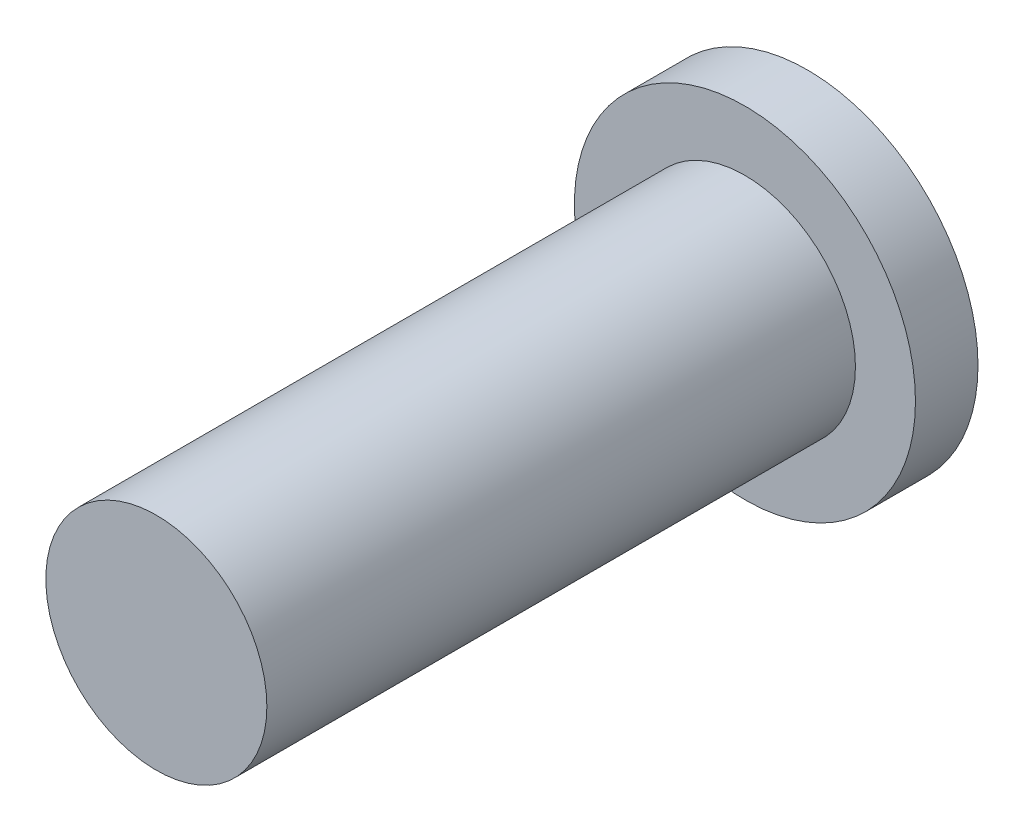
ISO-10303-21;
HEADER;
FILE_DESCRIPTION(('STEP AP214'),'2;1');
FILE_NAME('part.step','',(''),(''),'','','');
FILE_SCHEMA(('AUTOMOTIVE_DESIGN { 1 0 10303 214 1 1 1 1 }'));
ENDSEC;
DATA;
#1=APPLICATION_CONTEXT('core data for automotive mechanical design processes');
#2=APPLICATION_PROTOCOL_DEFINITION('international standard','automotive_design',2000,#1);
#3=PRODUCT_CONTEXT('',#1,'mechanical');
#4=PRODUCT('Part','Part','',(#3));
#5=PRODUCT_RELATED_PRODUCT_CATEGORY('part','',(#4));
#6=PRODUCT_DEFINITION_FORMATION('','',#4);
#7=PRODUCT_DEFINITION_CONTEXT('part definition',#1,'design');
#8=PRODUCT_DEFINITION('design','',#6,#7);
#9=PRODUCT_DEFINITION_SHAPE('','',#8);
#10=(LENGTH_UNIT() NAMED_UNIT(*) SI_UNIT(.MILLI.,.METRE.));
#11=(NAMED_UNIT(*) PLANE_ANGLE_UNIT() SI_UNIT($,.RADIAN.));
#12=(NAMED_UNIT(*) SI_UNIT($,.STERADIAN.) SOLID_ANGLE_UNIT());
#13=UNCERTAINTY_MEASURE_WITH_UNIT(LENGTH_MEASURE(1.E-05),#10,'distance_accuracy_value','');
#14=(GEOMETRIC_REPRESENTATION_CONTEXT(3) GLOBAL_UNCERTAINTY_ASSIGNED_CONTEXT((#13)) GLOBAL_UNIT_ASSIGNED_CONTEXT((#10,
#11,#12)) REPRESENTATION_CONTEXT('',''));
#15=CARTESIAN_POINT('',(0.,0.,0.));
#16=DIRECTION('',(0.,0.,1.));
#17=DIRECTION('',(1.,0.,0.));
#18=AXIS2_PLACEMENT_3D('',#15,#16,#17);
#19=CARTESIAN_POINT('',(0.,0.,85.));
#20=DIRECTION('',(0.,0.,-1.));
#21=DIRECTION('',(-1.,0.,0.));
#22=AXIS2_PLACEMENT_3D('',#19,#20,#21);
#23=CYLINDRICAL_SURFACE('',#22,231.805213469921);
#24=CARTESIAN_POINT('',(0.,0.,85.));
#25=DIRECTION('',(0.,0.,1.));
#26=DIRECTION('',(1.,0.,0.));
#27=AXIS2_PLACEMENT_3D('',#24,#25,#26);
#28=CIRCLE('',#27,231.805213469921);
#29=CARTESIAN_POINT('',(231.805213469921,0.,85.));
#30=VERTEX_POINT('',#29);
#31=EDGE_CURVE('E10',#30,#30,#28,.T.);
#32=ORIENTED_EDGE('',*,*,#31,.F.);
#33=EDGE_LOOP('',(#32));
#34=FACE_BOUND('',#33,.T.);
#35=CARTESIAN_POINT('',(0.,0.,0.));
#36=DIRECTION('',(0.,0.,1.));
#37=DIRECTION('',(1.,0.,0.));
#38=AXIS2_PLACEMENT_3D('',#35,#36,#37);
#39=CIRCLE('',#38,231.805213469921);
#40=CARTESIAN_POINT('',(231.805213469921,0.,0.));
#41=VERTEX_POINT('',#40);
#42=EDGE_CURVE('E42',#41,#41,#39,.T.);
#43=ORIENTED_EDGE('',*,*,#42,.T.);
#44=EDGE_LOOP('',(#43));
#45=FACE_BOUND('',#44,.T.);
#46=ADVANCED_FACE('F39',(#34,#45),#23,.T.);
#47=CARTESIAN_POINT('',(0.,0.,85.));
#48=DIRECTION('',(0.,0.,1.));
#49=DIRECTION('',(1.,0.,0.));
#50=AXIS2_PLACEMENT_3D('',#47,#48,#49);
#51=PLANE('',#50);
#52=CARTESIAN_POINT('',(0.,0.,85.));
#53=DIRECTION('',(0.,0.,1.));
#54=DIRECTION('',(1.,0.,0.));
#55=AXIS2_PLACEMENT_3D('',#52,#53,#54);
#56=CIRCLE('',#55,150.212654375261);
#57=CARTESIAN_POINT('',(150.212654375261,0.,85.));
#58=VERTEX_POINT('',#57);
#59=EDGE_CURVE('E49',#58,#58,#56,.T.);
#60=ORIENTED_EDGE('',*,*,#59,.F.);
#61=EDGE_LOOP('',(#60));
#62=FACE_BOUND('',#61,.T.);
#63=ORIENTED_EDGE('',*,*,#31,.T.);
#64=EDGE_LOOP('',(#63));
#65=FACE_BOUND('',#64,.T.);
#66=ADVANCED_FACE('F59',(#62,#65),#51,.T.);
#67=CARTESIAN_POINT('',(0.,0.,0.));
#68=DIRECTION('',(0.,0.,1.));
#69=DIRECTION('',(1.,0.,0.));
#70=AXIS2_PLACEMENT_3D('',#67,#68,#69);
#71=PLANE('',#70);
#72=ORIENTED_EDGE('',*,*,#42,.F.);
#73=EDGE_LOOP('',(#72));
#74=FACE_BOUND('',#73,.T.);
#75=ADVANCED_FACE('F61',(#74),#71,.F.);
#76=CARTESIAN_POINT('',(0.,0.,85.));
#77=DIRECTION('',(0.,0.,1.));
#78=DIRECTION('',(1.,0.,0.));
#79=AXIS2_PLACEMENT_3D('',#76,#77,#78);
#80=CYLINDRICAL_SURFACE('',#79,150.212654375261);
#81=CARTESIAN_POINT('',(0.,0.,885.));
#82=DIRECTION('',(0.,0.,1.));
#83=DIRECTION('',(1.,0.,0.));
#84=AXIS2_PLACEMENT_3D('',#81,#82,#83);
#85=CIRCLE('',#84,150.212654375261);
#86=CARTESIAN_POINT('',(150.212654375261,0.,885.));
#87=VERTEX_POINT('',#86);
#88=EDGE_CURVE('E51',#87,#87,#85,.T.);
#89=ORIENTED_EDGE('',*,*,#88,.F.);
#90=EDGE_LOOP('',(#89));
#91=FACE_BOUND('',#90,.T.);
#92=ORIENTED_EDGE('',*,*,#59,.T.);
#93=EDGE_LOOP('',(#92));
#94=FACE_BOUND('',#93,.T.);
#95=ADVANCED_FACE('F57',(#91,#94),#80,.T.);
#96=CARTESIAN_POINT('',(0.,0.,885.));
#97=DIRECTION('',(0.,0.,1.));
#98=DIRECTION('',(1.,0.,0.));
#99=AXIS2_PLACEMENT_3D('',#96,#97,#98);
#100=PLANE('',#99);
#101=ORIENTED_EDGE('',*,*,#88,.T.);
#102=EDGE_LOOP('',(#101));
#103=FACE_BOUND('',#102,.T.);
#104=ADVANCED_FACE('F70',(#103),#100,.T.);
#105=CLOSED_SHELL('',(#46,#66,#75,#95,#104));
#106=MANIFOLD_SOLID_BREP('B2',#105);
#107=ADVANCED_BREP_SHAPE_REPRESENTATION('',(#18,#106),#14);
#108=SHAPE_DEFINITION_REPRESENTATION(#9,#107);
ENDSEC;
END-ISO-10303-21;
